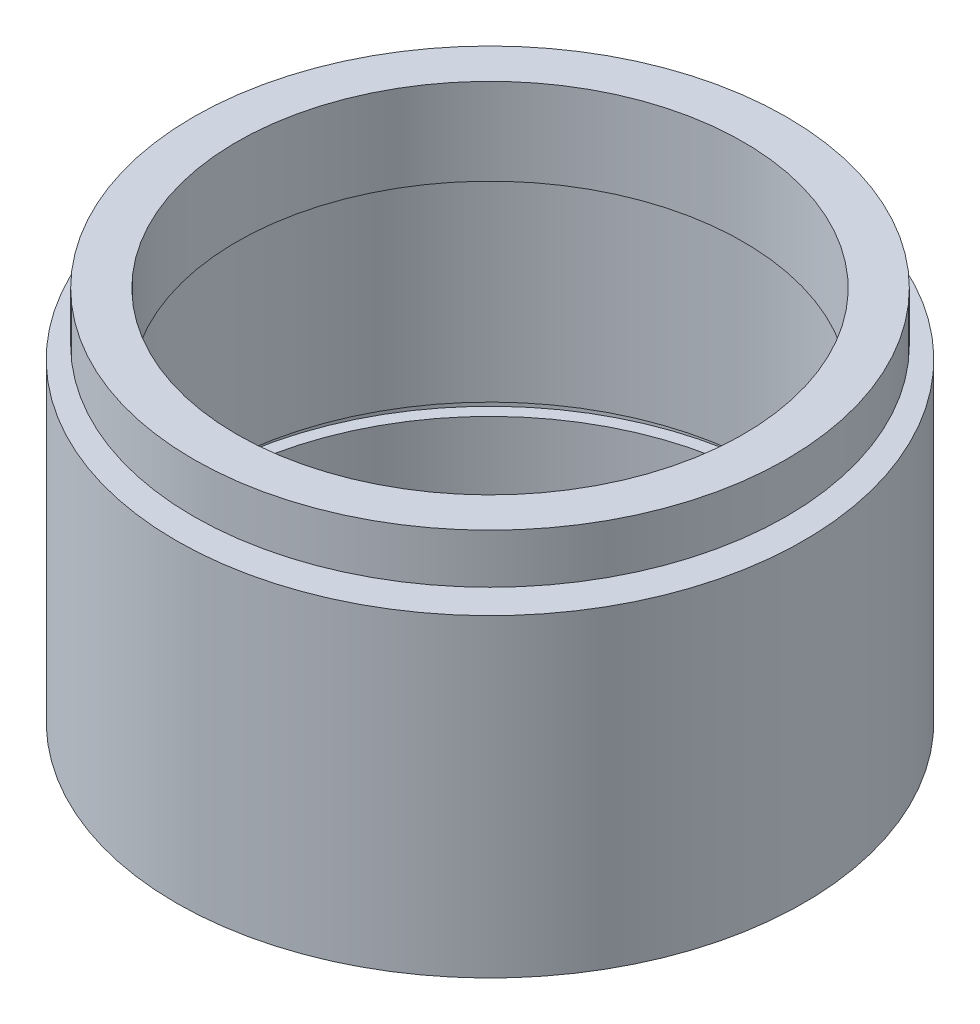
ISO-10303-21;
HEADER;
FILE_DESCRIPTION(('STEP AP214'),'2;1');
FILE_NAME('part.step','',(''),(''),'','','');
FILE_SCHEMA(('AUTOMOTIVE_DESIGN { 1 0 10303 214 1 1 1 1 }'));
ENDSEC;
DATA;
#1=APPLICATION_CONTEXT('core data for automotive mechanical design processes');
#2=APPLICATION_PROTOCOL_DEFINITION('international standard','automotive_design',2000,#1);
#3=PRODUCT_CONTEXT('',#1,'mechanical');
#4=PRODUCT('Part','Part','',(#3));
#5=PRODUCT_RELATED_PRODUCT_CATEGORY('part','',(#4));
#6=PRODUCT_DEFINITION_FORMATION('','',#4);
#7=PRODUCT_DEFINITION_CONTEXT('part definition',#1,'design');
#8=PRODUCT_DEFINITION('design','',#6,#7);
#9=PRODUCT_DEFINITION_SHAPE('','',#8);
#10=(LENGTH_UNIT() NAMED_UNIT(*) SI_UNIT(.MILLI.,.METRE.));
#11=(NAMED_UNIT(*) PLANE_ANGLE_UNIT() SI_UNIT($,.RADIAN.));
#12=(NAMED_UNIT(*) SI_UNIT($,.STERADIAN.) SOLID_ANGLE_UNIT());
#13=UNCERTAINTY_MEASURE_WITH_UNIT(LENGTH_MEASURE(1.E-05),#10,'distance_accuracy_value','');
#14=(GEOMETRIC_REPRESENTATION_CONTEXT(3) GLOBAL_UNCERTAINTY_ASSIGNED_CONTEXT((#13)) GLOBAL_UNIT_ASSIGNED_CONTEXT((#10,
#11,#12)) REPRESENTATION_CONTEXT('',''));
#15=CARTESIAN_POINT('',(0.,0.,0.));
#16=DIRECTION('',(0.,0.,1.));
#17=DIRECTION('',(1.,0.,0.));
#18=AXIS2_PLACEMENT_3D('',#15,#16,#17);
#19=CARTESIAN_POINT('',(25.4,25.4,0.));
#20=DIRECTION('',(0.,-1.,0.));
#21=DIRECTION('',(0.,0.,-1.));
#22=AXIS2_PLACEMENT_3D('',#19,#20,#21);
#23=PLANE('',#22);
#24=CARTESIAN_POINT('',(0.,25.4,0.));
#25=DIRECTION('',(0.,1.,0.));
#26=DIRECTION('',(0.,0.,1.));
#27=AXIS2_PLACEMENT_3D('',#24,#25,#26);
#28=CIRCLE('',#27,22.4999999999999);
#29=CARTESIAN_POINT('',(0.,25.4,22.4999999999999));
#30=VERTEX_POINT('',#29);
#31=EDGE_CURVE('E89',#30,#30,#28,.T.);
#32=ORIENTED_EDGE('',*,*,#31,.F.);
#33=EDGE_LOOP('',(#32));
#34=FACE_BOUND('',#33,.T.);
#35=CARTESIAN_POINT('',(0.,25.4,0.));
#36=DIRECTION('',(0.,1.,0.));
#37=DIRECTION('',(0.,0.,1.));
#38=AXIS2_PLACEMENT_3D('',#35,#36,#37);
#39=CIRCLE('',#38,25.4);
#40=CARTESIAN_POINT('',(0.,25.4,25.4));
#41=VERTEX_POINT('',#40);
#42=EDGE_CURVE('E10',#41,#41,#39,.T.);
#43=ORIENTED_EDGE('',*,*,#42,.T.);
#44=EDGE_LOOP('',(#43));
#45=FACE_BOUND('',#44,.T.);
#46=ADVANCED_FACE('F37',(#34,#45),#23,.F.);
#47=CARTESIAN_POINT('',(0.,161.376166943427,0.));
#48=DIRECTION('',(0.,1.,0.));
#49=DIRECTION('',(0.,0.,1.));
#50=AXIS2_PLACEMENT_3D('',#47,#48,#49);
#51=CYLINDRICAL_SURFACE('',#50,25.4);
#52=ORIENTED_EDGE('',*,*,#42,.F.);
#53=EDGE_LOOP('',(#52));
#54=FACE_BOUND('',#53,.T.);
#55=CARTESIAN_POINT('',(0.,0.,0.));
#56=DIRECTION('',(0.,1.,0.));
#57=DIRECTION('',(0.,0.,1.));
#58=AXIS2_PLACEMENT_3D('',#55,#56,#57);
#59=CIRCLE('',#58,25.4);
#60=CARTESIAN_POINT('',(0.,0.,25.4));
#61=VERTEX_POINT('',#60);
#62=EDGE_CURVE('E43',#61,#61,#59,.T.);
#63=ORIENTED_EDGE('',*,*,#62,.T.);
#64=EDGE_LOOP('',(#63));
#65=FACE_BOUND('',#64,.T.);
#66=ADVANCED_FACE('F96',(#54,#65),#51,.T.);
#67=CARTESIAN_POINT('',(25.4,0.,0.));
#68=DIRECTION('',(0.,1.,0.));
#69=DIRECTION('',(0.,0.,1.));
#70=AXIS2_PLACEMENT_3D('',#67,#68,#69);
#71=PLANE('',#70);
#72=ORIENTED_EDGE('',*,*,#62,.F.);
#73=EDGE_LOOP('',(#72));
#74=FACE_BOUND('',#73,.T.);
#75=CARTESIAN_POINT('',(0.,0.,0.));
#76=DIRECTION('',(0.,1.,0.));
#77=DIRECTION('',(0.,0.,1.));
#78=AXIS2_PLACEMENT_3D('',#75,#76,#77);
#79=CIRCLE('',#78,22.5);
#80=CARTESIAN_POINT('',(0.,0.,22.5));
#81=VERTEX_POINT('',#80);
#82=EDGE_CURVE('E47',#81,#81,#79,.T.);
#83=ORIENTED_EDGE('',*,*,#82,.T.);
#84=EDGE_LOOP('',(#83));
#85=FACE_BOUND('',#84,.T.);
#86=ADVANCED_FACE('F100',(#74,#85),#71,.F.);
#87=CARTESIAN_POINT('',(0.,161.376166943427,0.));
#88=DIRECTION('',(0.,1.,0.));
#89=DIRECTION('',(0.,0.,1.));
#90=AXIS2_PLACEMENT_3D('',#87,#88,#89);
#91=CYLINDRICAL_SURFACE('',#90,22.5);
#92=ORIENTED_EDGE('',*,*,#82,.F.);
#93=EDGE_LOOP('',(#92));
#94=FACE_BOUND('',#93,.T.);
#95=CARTESIAN_POINT('',(0.,5.49999999999998,0.));
#96=DIRECTION('',(0.,1.,0.));
#97=DIRECTION('',(0.,0.,1.));
#98=AXIS2_PLACEMENT_3D('',#95,#96,#97);
#99=CIRCLE('',#98,22.5);
#100=CARTESIAN_POINT('',(0.,5.49999999999998,22.5));
#101=VERTEX_POINT('',#100);
#102=EDGE_CURVE('E51',#101,#101,#99,.T.);
#103=ORIENTED_EDGE('',*,*,#102,.T.);
#104=EDGE_LOOP('',(#103));
#105=FACE_BOUND('',#104,.T.);
#106=ADVANCED_FACE('F105',(#94,#105),#91,.F.);
#107=CARTESIAN_POINT('',(22.5,5.49999999999999,0.));
#108=DIRECTION('',(0.,-1.,0.));
#109=DIRECTION('',(0.,0.,-1.));
#110=AXIS2_PLACEMENT_3D('',#107,#108,#109);
#111=PLANE('',#110);
#112=ORIENTED_EDGE('',*,*,#102,.F.);
#113=EDGE_LOOP('',(#112));
#114=FACE_BOUND('',#113,.T.);
#115=CARTESIAN_POINT('',(0.,5.49999999999998,0.));
#116=DIRECTION('',(0.,1.,0.));
#117=DIRECTION('',(0.,0.,1.));
#118=AXIS2_PLACEMENT_3D('',#115,#116,#117);
#119=CIRCLE('',#118,23.4999999999999);
#120=CARTESIAN_POINT('',(0.,5.49999999999998,23.4999999999999));
#121=VERTEX_POINT('',#120);
#122=EDGE_CURVE('E56',#121,#121,#119,.T.);
#123=ORIENTED_EDGE('',*,*,#122,.T.);
#124=EDGE_LOOP('',(#123));
#125=FACE_BOUND('',#124,.T.);
#126=ADVANCED_FACE('F111',(#114,#125),#111,.F.);
#127=CARTESIAN_POINT('',(0.,161.376166943427,0.));
#128=DIRECTION('',(0.,1.,0.));
#129=DIRECTION('',(0.,0.,1.));
#130=AXIS2_PLACEMENT_3D('',#127,#128,#129);
#131=CYLINDRICAL_SURFACE('',#130,23.4999999999999);
#132=ORIENTED_EDGE('',*,*,#122,.F.);
#133=EDGE_LOOP('',(#132));
#134=FACE_BOUND('',#133,.T.);
#135=CARTESIAN_POINT('',(0.,6.49999999999998,0.));
#136=DIRECTION('',(0.,1.,0.));
#137=DIRECTION('',(0.,0.,1.));
#138=AXIS2_PLACEMENT_3D('',#135,#136,#137);
#139=CIRCLE('',#138,23.4999999999999);
#140=CARTESIAN_POINT('',(0.,6.49999999999998,23.4999999999999));
#141=VERTEX_POINT('',#140);
#142=EDGE_CURVE('E59',#141,#141,#139,.T.);
#143=ORIENTED_EDGE('',*,*,#142,.T.);
#144=EDGE_LOOP('',(#143));
#145=FACE_BOUND('',#144,.T.);
#146=ADVANCED_FACE('F115',(#134,#145),#131,.F.);
#147=CARTESIAN_POINT('',(23.4999999999999,6.49999999999999,0.));
#148=DIRECTION('',(0.,1.,0.));
#149=DIRECTION('',(0.,0.,1.));
#150=AXIS2_PLACEMENT_3D('',#147,#148,#149);
#151=PLANE('',#150);
#152=ORIENTED_EDGE('',*,*,#142,.F.);
#153=EDGE_LOOP('',(#152));
#154=FACE_BOUND('',#153,.T.);
#155=CARTESIAN_POINT('',(0.,6.49999999999998,0.));
#156=DIRECTION('',(0.,1.,0.));
#157=DIRECTION('',(0.,0.,1.));
#158=AXIS2_PLACEMENT_3D('',#155,#156,#157);
#159=CIRCLE('',#158,22.5);
#160=CARTESIAN_POINT('',(0.,6.49999999999998,22.5));
#161=VERTEX_POINT('',#160);
#162=EDGE_CURVE('E62',#161,#161,#159,.T.);
#163=ORIENTED_EDGE('',*,*,#162,.T.);
#164=EDGE_LOOP('',(#163));
#165=FACE_BOUND('',#164,.T.);
#166=ADVANCED_FACE('F119',(#154,#165),#151,.F.);
#167=CARTESIAN_POINT('',(0.,161.376166943427,0.));
#168=DIRECTION('',(0.,1.,0.));
#169=DIRECTION('',(0.,0.,1.));
#170=AXIS2_PLACEMENT_3D('',#167,#168,#169);
#171=CYLINDRICAL_SURFACE('',#170,22.5);
#172=ORIENTED_EDGE('',*,*,#162,.F.);
#173=EDGE_LOOP('',(#172));
#174=FACE_BOUND('',#173,.T.);
#175=CARTESIAN_POINT('',(0.,22.4,0.));
#176=DIRECTION('',(0.,1.,0.));
#177=DIRECTION('',(0.,0.,1.));
#178=AXIS2_PLACEMENT_3D('',#175,#176,#177);
#179=CIRCLE('',#178,22.5);
#180=CARTESIAN_POINT('',(0.,22.4,22.5));
#181=VERTEX_POINT('',#180);
#182=EDGE_CURVE('E65',#181,#181,#179,.T.);
#183=ORIENTED_EDGE('',*,*,#182,.T.);
#184=EDGE_LOOP('',(#183));
#185=FACE_BOUND('',#184,.T.);
#186=ADVANCED_FACE('F123',(#174,#185),#171,.F.);
#187=CARTESIAN_POINT('',(22.5,22.4,0.));
#188=DIRECTION('',(0.,-1.,0.));
#189=DIRECTION('',(0.,0.,-1.));
#190=AXIS2_PLACEMENT_3D('',#187,#188,#189);
#191=PLANE('',#190);
#192=ORIENTED_EDGE('',*,*,#182,.F.);
#193=EDGE_LOOP('',(#192));
#194=FACE_BOUND('',#193,.T.);
#195=CARTESIAN_POINT('',(0.,22.4,0.));
#196=DIRECTION('',(0.,1.,0.));
#197=DIRECTION('',(0.,0.,1.));
#198=AXIS2_PLACEMENT_3D('',#195,#196,#197);
#199=CIRCLE('',#198,24.);
#200=CARTESIAN_POINT('',(0.,22.4,24.));
#201=VERTEX_POINT('',#200);
#202=EDGE_CURVE('E68',#201,#201,#199,.T.);
#203=ORIENTED_EDGE('',*,*,#202,.T.);
#204=EDGE_LOOP('',(#203));
#205=FACE_BOUND('',#204,.T.);
#206=ADVANCED_FACE('F127',(#194,#205),#191,.F.);
#207=CARTESIAN_POINT('',(0.,161.376166943427,0.));
#208=DIRECTION('',(0.,1.,0.));
#209=DIRECTION('',(0.,0.,1.));
#210=AXIS2_PLACEMENT_3D('',#207,#208,#209);
#211=CYLINDRICAL_SURFACE('',#210,24.);
#212=ORIENTED_EDGE('',*,*,#202,.F.);
#213=EDGE_LOOP('',(#212));
#214=FACE_BOUND('',#213,.T.);
#215=CARTESIAN_POINT('',(0.,23.4,0.));
#216=DIRECTION('',(0.,1.,0.));
#217=DIRECTION('',(0.,0.,1.));
#218=AXIS2_PLACEMENT_3D('',#215,#216,#217);
#219=CIRCLE('',#218,24.);
#220=CARTESIAN_POINT('',(0.,23.4,24.));
#221=VERTEX_POINT('',#220);
#222=EDGE_CURVE('E71',#221,#221,#219,.T.);
#223=ORIENTED_EDGE('',*,*,#222,.T.);
#224=EDGE_LOOP('',(#223));
#225=FACE_BOUND('',#224,.T.);
#226=ADVANCED_FACE('F131',(#214,#225),#211,.F.);
#227=CARTESIAN_POINT('',(24.,23.4,0.));
#228=DIRECTION('',(0.,1.,0.));
#229=DIRECTION('',(0.,0.,1.));
#230=AXIS2_PLACEMENT_3D('',#227,#228,#229);
#231=PLANE('',#230);
#232=ORIENTED_EDGE('',*,*,#222,.F.);
#233=EDGE_LOOP('',(#232));
#234=FACE_BOUND('',#233,.T.);
#235=CARTESIAN_POINT('',(0.,23.4,0.));
#236=DIRECTION('',(0.,1.,0.));
#237=DIRECTION('',(0.,0.,1.));
#238=AXIS2_PLACEMENT_3D('',#235,#236,#237);
#239=CIRCLE('',#238,20.5);
#240=CARTESIAN_POINT('',(0.,23.4,20.5));
#241=VERTEX_POINT('',#240);
#242=EDGE_CURVE('E74',#241,#241,#239,.T.);
#243=ORIENTED_EDGE('',*,*,#242,.T.);
#244=EDGE_LOOP('',(#243));
#245=FACE_BOUND('',#244,.T.);
#246=ADVANCED_FACE('F135',(#234,#245),#231,.F.);
#247=CARTESIAN_POINT('',(0.,161.376166943427,0.));
#248=DIRECTION('',(0.,1.,0.));
#249=DIRECTION('',(0.,0.,1.));
#250=AXIS2_PLACEMENT_3D('',#247,#248,#249);
#251=CYLINDRICAL_SURFACE('',#250,20.5);
#252=ORIENTED_EDGE('',*,*,#242,.F.);
#253=EDGE_LOOP('',(#252));
#254=FACE_BOUND('',#253,.T.);
#255=CARTESIAN_POINT('',(0.,30.4,0.));
#256=DIRECTION('',(0.,1.,0.));
#257=DIRECTION('',(0.,0.,1.));
#258=AXIS2_PLACEMENT_3D('',#255,#256,#257);
#259=CIRCLE('',#258,20.5);
#260=CARTESIAN_POINT('',(0.,30.4,20.5));
#261=VERTEX_POINT('',#260);
#262=EDGE_CURVE('E77',#261,#261,#259,.T.);
#263=ORIENTED_EDGE('',*,*,#262,.T.);
#264=EDGE_LOOP('',(#263));
#265=FACE_BOUND('',#264,.T.);
#266=ADVANCED_FACE('F139',(#254,#265),#251,.F.);
#267=CARTESIAN_POINT('',(20.5,30.4,0.));
#268=DIRECTION('',(0.,-1.,0.));
#269=DIRECTION('',(0.,0.,-1.));
#270=AXIS2_PLACEMENT_3D('',#267,#268,#269);
#271=PLANE('',#270);
#272=ORIENTED_EDGE('',*,*,#262,.F.);
#273=EDGE_LOOP('',(#272));
#274=FACE_BOUND('',#273,.T.);
#275=CARTESIAN_POINT('',(0.,30.4,0.));
#276=DIRECTION('',(0.,1.,0.));
#277=DIRECTION('',(0.,0.,1.));
#278=AXIS2_PLACEMENT_3D('',#275,#276,#277);
#279=CIRCLE('',#278,24.);
#280=CARTESIAN_POINT('',(0.,30.4,24.));
#281=VERTEX_POINT('',#280);
#282=EDGE_CURVE('E80',#281,#281,#279,.T.);
#283=ORIENTED_EDGE('',*,*,#282,.T.);
#284=EDGE_LOOP('',(#283));
#285=FACE_BOUND('',#284,.T.);
#286=ADVANCED_FACE('F143',(#274,#285),#271,.F.);
#287=CARTESIAN_POINT('',(0.,161.376166943427,0.));
#288=DIRECTION('',(0.,1.,0.));
#289=DIRECTION('',(0.,0.,1.));
#290=AXIS2_PLACEMENT_3D('',#287,#288,#289);
#291=CYLINDRICAL_SURFACE('',#290,24.);
#292=ORIENTED_EDGE('',*,*,#282,.F.);
#293=EDGE_LOOP('',(#292));
#294=FACE_BOUND('',#293,.T.);
#295=CARTESIAN_POINT('',(0.,26.4,0.));
#296=DIRECTION('',(0.,1.,0.));
#297=DIRECTION('',(0.,0.,1.));
#298=AXIS2_PLACEMENT_3D('',#295,#296,#297);
#299=CIRCLE('',#298,24.);
#300=CARTESIAN_POINT('',(0.,26.4,24.));
#301=VERTEX_POINT('',#300);
#302=EDGE_CURVE('E83',#301,#301,#299,.T.);
#303=ORIENTED_EDGE('',*,*,#302,.T.);
#304=EDGE_LOOP('',(#303));
#305=FACE_BOUND('',#304,.T.);
#306=ADVANCED_FACE('F147',(#294,#305),#291,.T.);
#307=CARTESIAN_POINT('',(24.,26.4,0.));
#308=DIRECTION('',(0.,1.,0.));
#309=DIRECTION('',(0.,0.,1.));
#310=AXIS2_PLACEMENT_3D('',#307,#308,#309);
#311=PLANE('',#310);
#312=ORIENTED_EDGE('',*,*,#302,.F.);
#313=EDGE_LOOP('',(#312));
#314=FACE_BOUND('',#313,.T.);
#315=CARTESIAN_POINT('',(0.,26.4,0.));
#316=DIRECTION('',(0.,1.,0.));
#317=DIRECTION('',(0.,0.,1.));
#318=AXIS2_PLACEMENT_3D('',#315,#316,#317);
#319=CIRCLE('',#318,22.4999999999999);
#320=CARTESIAN_POINT('',(0.,26.4,22.4999999999999));
#321=VERTEX_POINT('',#320);
#322=EDGE_CURVE('E86',#321,#321,#319,.T.);
#323=ORIENTED_EDGE('',*,*,#322,.T.);
#324=EDGE_LOOP('',(#323));
#325=FACE_BOUND('',#324,.T.);
#326=ADVANCED_FACE('F151',(#314,#325),#311,.F.);
#327=CARTESIAN_POINT('',(0.,161.376166943427,0.));
#328=DIRECTION('',(0.,1.,0.));
#329=DIRECTION('',(0.,0.,1.));
#330=AXIS2_PLACEMENT_3D('',#327,#328,#329);
#331=CYLINDRICAL_SURFACE('',#330,22.4999999999999);
#332=ORIENTED_EDGE('',*,*,#322,.F.);
#333=EDGE_LOOP('',(#332));
#334=FACE_BOUND('',#333,.T.);
#335=ORIENTED_EDGE('',*,*,#31,.T.);
#336=EDGE_LOOP('',(#335));
#337=FACE_BOUND('',#336,.T.);
#338=ADVANCED_FACE('F93',(#334,#337),#331,.T.);
#339=CLOSED_SHELL('',(#46,#66,#86,#106,#126,#146,#166,#186,#206,#226,#246,#266,#286,#306,#326,#338));
#340=MANIFOLD_SOLID_BREP('B2',#339);
#341=ADVANCED_BREP_SHAPE_REPRESENTATION('',(#18,#340),#14);
#342=SHAPE_DEFINITION_REPRESENTATION(#9,#341);
ENDSEC;
END-ISO-10303-21;
